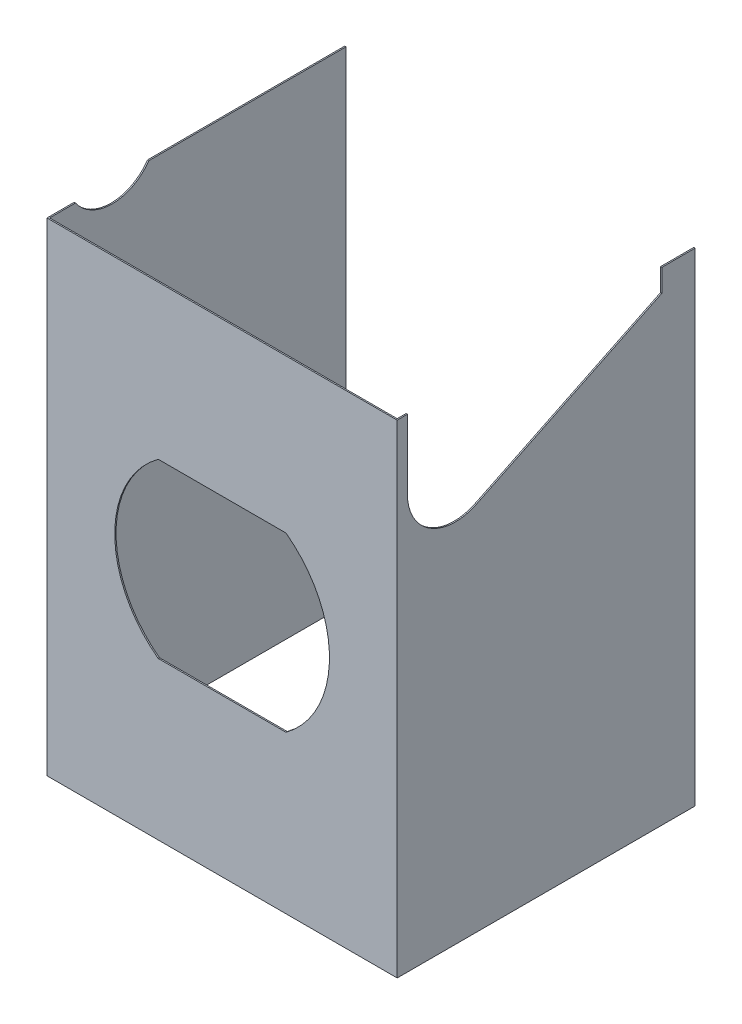
ISO-10303-21;
HEADER;
FILE_DESCRIPTION(('STEP AP214'),'2;1');
FILE_NAME('part.step','',(''),(''),'','','');
FILE_SCHEMA(('AUTOMOTIVE_DESIGN { 1 0 10303 214 1 1 1 1 }'));
ENDSEC;
DATA;
#1=APPLICATION_CONTEXT('core data for automotive mechanical design processes');
#2=APPLICATION_PROTOCOL_DEFINITION('international standard','automotive_design',2000,#1);
#3=PRODUCT_CONTEXT('',#1,'mechanical');
#4=PRODUCT('Part','Part','',(#3));
#5=PRODUCT_RELATED_PRODUCT_CATEGORY('part','',(#4));
#6=PRODUCT_DEFINITION_FORMATION('','',#4);
#7=PRODUCT_DEFINITION_CONTEXT('part definition',#1,'design');
#8=PRODUCT_DEFINITION('design','',#6,#7);
#9=PRODUCT_DEFINITION_SHAPE('','',#8);
#10=(LENGTH_UNIT() NAMED_UNIT(*) SI_UNIT(.MILLI.,.METRE.));
#11=(NAMED_UNIT(*) PLANE_ANGLE_UNIT() SI_UNIT($,.RADIAN.));
#12=(NAMED_UNIT(*) SI_UNIT($,.STERADIAN.) SOLID_ANGLE_UNIT());
#13=UNCERTAINTY_MEASURE_WITH_UNIT(LENGTH_MEASURE(1.E-05),#10,'distance_accuracy_value','');
#14=(GEOMETRIC_REPRESENTATION_CONTEXT(3) GLOBAL_UNCERTAINTY_ASSIGNED_CONTEXT((#13)) GLOBAL_UNIT_ASSIGNED_CONTEXT((#10,
#11,#12)) REPRESENTATION_CONTEXT('',''));
#15=CARTESIAN_POINT('',(0.,0.,0.));
#16=DIRECTION('',(0.,0.,1.));
#17=DIRECTION('',(1.,0.,0.));
#18=AXIS2_PLACEMENT_3D('',#15,#16,#17);
#19=CARTESIAN_POINT('',(0.,48.006,-0.254));
#20=DIRECTION('',(0.,-1.,0.));
#21=DIRECTION('',(0.,0.,-1.));
#22=AXIS2_PLACEMENT_3D('',#19,#20,#21);
#23=PLANE('',#22);
#24=DIRECTION('',(0.,0.,1.));
#25=VECTOR('',#24,1.);
#26=CARTESIAN_POINT('',(-34.544,48.006,0.));
#27=LINE('',#26,#25);
#28=CARTESIAN_POINT('',(-34.544,48.006,-5.4044054388967));
#29=VERTEX_POINT('',#28);
#30=CARTESIAN_POINT('',(-34.544,48.006,-0.254));
#31=VERTEX_POINT('',#30);
#32=EDGE_CURVE('E217',#29,#31,#27,.T.);
#33=ORIENTED_EDGE('',*,*,#32,.F.);
#34=DIRECTION('',(-1.,0.,0.));
#35=VECTOR('',#34,1.);
#36=CARTESIAN_POINT('',(-34.544,48.006,-5.4044054388967));
#37=LINE('',#36,#35);
#38=CARTESIAN_POINT('',(-34.798,48.006,-5.4044054388967));
#39=VERTEX_POINT('',#38);
#40=EDGE_CURVE('E72',#29,#39,#37,.T.);
#41=ORIENTED_EDGE('',*,*,#40,.T.);
#42=DIRECTION('',(0.,0.,1.));
#43=VECTOR('',#42,1.);
#44=CARTESIAN_POINT('',(-34.798,48.006,-0.254));
#45=LINE('',#44,#43);
#46=CARTESIAN_POINT('',(-34.798,48.006,0.));
#47=VERTEX_POINT('',#46);
#48=EDGE_CURVE('E371',#39,#47,#45,.T.);
#49=ORIENTED_EDGE('',*,*,#48,.T.);
#50=DIRECTION('',(1.,0.,0.));
#51=VECTOR('',#50,1.);
#52=CARTESIAN_POINT('',(0.,48.006,0.));
#53=LINE('',#52,#51);
#54=CARTESIAN_POINT('',(34.544,48.006,0.));
#55=VERTEX_POINT('',#54);
#56=EDGE_CURVE('E361',#47,#55,#53,.T.);
#57=ORIENTED_EDGE('',*,*,#56,.T.);
#58=DIRECTION('',(0.,0.,-1.));
#59=VECTOR('',#58,1.);
#60=CARTESIAN_POINT('',(34.544,48.006,-0.254));
#61=LINE('',#60,#59);
#62=CARTESIAN_POINT('',(34.544,48.006,-0.254));
#63=VERTEX_POINT('',#62);
#64=EDGE_CURVE('E312',#55,#63,#61,.T.);
#65=ORIENTED_EDGE('',*,*,#64,.T.);
#66=DIRECTION('',(1.,0.,0.));
#67=VECTOR('',#66,1.);
#68=CARTESIAN_POINT('',(0.,48.006,-0.254));
#69=LINE('',#68,#67);
#70=EDGE_CURVE('E339',#31,#63,#69,.T.);
#71=ORIENTED_EDGE('',*,*,#70,.F.);
#72=EDGE_LOOP('',(#33,#41,#49,#57,#65,#71));
#73=FACE_BOUND('',#72,.T.);
#74=ADVANCED_FACE('F56',(#73),#23,.F.);
#75=CARTESIAN_POINT('',(34.544,48.0095573922283,0.));
#76=DIRECTION('',(0.,1.,0.));
#77=DIRECTION('',(0.,0.,1.));
#78=AXIS2_PLACEMENT_3D('',#75,#76,#77);
#79=PLANE('',#78);
#80=DIRECTION('',(1.,0.,0.));
#81=VECTOR('',#80,1.);
#82=CARTESIAN_POINT('',(34.544,48.0095573922283,-2.03200000000001));
#83=LINE('',#82,#81);
#84=CARTESIAN_POINT('',(34.544,48.0095573922283,-2.03200000000001));
#85=VERTEX_POINT('',#84);
#86=CARTESIAN_POINT('',(34.798,48.0095573922283,-2.03200000000001));
#87=VERTEX_POINT('',#86);
#88=EDGE_CURVE('E271',#85,#87,#83,.T.);
#89=ORIENTED_EDGE('',*,*,#88,.F.);
#90=DIRECTION('',(0.,0.,1.));
#91=VECTOR('',#90,1.);
#92=CARTESIAN_POINT('',(34.544,48.0095573922283,0.));
#93=LINE('',#92,#91);
#94=CARTESIAN_POINT('',(34.544,48.0095573922283,0.));
#95=VERTEX_POINT('',#94);
#96=EDGE_CURVE('E295',#85,#95,#93,.T.);
#97=ORIENTED_EDGE('',*,*,#96,.T.);
#98=DIRECTION('',(1.,0.,0.));
#99=VECTOR('',#98,1.);
#100=CARTESIAN_POINT('',(34.544,48.0095573922283,0.));
#101=LINE('',#100,#99);
#102=CARTESIAN_POINT('',(34.798,48.0095573922283,0.));
#103=VERTEX_POINT('',#102);
#104=EDGE_CURVE('E308',#95,#103,#101,.T.);
#105=ORIENTED_EDGE('',*,*,#104,.T.);
#106=DIRECTION('',(0.,0.,1.));
#107=VECTOR('',#106,1.);
#108=CARTESIAN_POINT('',(34.798,48.0095573922283,0.));
#109=LINE('',#108,#107);
#110=EDGE_CURVE('E304',#87,#103,#109,.T.);
#111=ORIENTED_EDGE('',*,*,#110,.F.);
#112=EDGE_LOOP('',(#89,#97,#105,#111));
#113=FACE_BOUND('',#112,.T.);
#114=ADVANCED_FACE('F444',(#113),#79,.T.);
#115=CARTESIAN_POINT('',(0.,0.,0.));
#116=DIRECTION('',(0.,0.,1.));
#117=DIRECTION('',(1.,0.,0.));
#118=AXIS2_PLACEMENT_3D('',#115,#116,#117);
#119=PLANE('',#118);
#120=DIRECTION('',(1.,0.,0.));
#121=VECTOR('',#120,1.);
#122=CARTESIAN_POINT('',(0.,17.526,0.));
#123=LINE('',#122,#121);
#124=CARTESIAN_POINT('',(-12.6993649841242,17.526,0.));
#125=VERTEX_POINT('',#124);
#126=CARTESIAN_POINT('',(12.6993649841242,17.526,0.));
#127=VERTEX_POINT('',#126);
#128=EDGE_CURVE('E351',#125,#127,#123,.T.);
#129=ORIENTED_EDGE('',*,*,#128,.T.);
#130=CARTESIAN_POINT('',(0.,0.381000000000003,0.));
#131=DIRECTION('',(0.,0.,1.));
#132=DIRECTION('',(1.,0.,0.));
#133=AXIS2_PLACEMENT_3D('',#130,#131,#132);
#134=CIRCLE('',#133,21.336);
#135=CARTESIAN_POINT('',(12.6993649841242,-16.764,0.));
#136=VERTEX_POINT('',#135);
#137=EDGE_CURVE('E322',#136,#127,#134,.T.);
#138=ORIENTED_EDGE('',*,*,#137,.F.);
#139=DIRECTION('',(1.,0.,0.));
#140=VECTOR('',#139,1.);
#141=CARTESIAN_POINT('',(0.,-16.764,0.));
#142=LINE('',#141,#140);
#143=CARTESIAN_POINT('',(-12.6993649841242,-16.764,0.));
#144=VERTEX_POINT('',#143);
#145=EDGE_CURVE('E345',#144,#136,#142,.T.);
#146=ORIENTED_EDGE('',*,*,#145,.F.);
#147=CARTESIAN_POINT('',(0.,0.381000000000003,0.));
#148=DIRECTION('',(0.,0.,1.));
#149=DIRECTION('',(1.,0.,0.));
#150=AXIS2_PLACEMENT_3D('',#147,#148,#149);
#151=CIRCLE('',#150,21.336);
#152=EDGE_CURVE('E348',#125,#144,#151,.T.);
#153=ORIENTED_EDGE('',*,*,#152,.F.);
#154=EDGE_LOOP('',(#129,#138,#146,#153));
#155=FACE_BOUND('',#154,.T.);
#156=DIRECTION('',(0.,1.,0.));
#157=VECTOR('',#156,1.);
#158=CARTESIAN_POINT('',(34.798,0.,0.));
#159=LINE('',#158,#157);
#160=CARTESIAN_POINT('',(34.798,-48.006,0.));
#161=VERTEX_POINT('',#160);
#162=EDGE_CURVE('E358',#161,#103,#159,.T.);
#163=ORIENTED_EDGE('',*,*,#162,.T.);
#164=ORIENTED_EDGE('',*,*,#104,.F.);
#165=DIRECTION('',(0.,-1.,0.));
#166=VECTOR('',#165,1.);
#167=CARTESIAN_POINT('',(34.544,-48.006,0.));
#168=LINE('',#167,#166);
#169=EDGE_CURVE('E283',#95,#55,#168,.T.);
#170=ORIENTED_EDGE('',*,*,#169,.T.);
#171=ORIENTED_EDGE('',*,*,#56,.F.);
#172=DIRECTION('',(0.,1.,0.));
#173=VECTOR('',#172,1.);
#174=CARTESIAN_POINT('',(-34.798,0.,0.));
#175=LINE('',#174,#173);
#176=CARTESIAN_POINT('',(-34.798,-48.006,0.));
#177=VERTEX_POINT('',#176);
#178=EDGE_CURVE('E327',#177,#47,#175,.T.);
#179=ORIENTED_EDGE('',*,*,#178,.F.);
#180=DIRECTION('',(1.,0.,0.));
#181=VECTOR('',#180,1.);
#182=CARTESIAN_POINT('',(0.,-48.006,0.));
#183=LINE('',#182,#181);
#184=EDGE_CURVE('E355',#177,#161,#183,.T.);
#185=ORIENTED_EDGE('',*,*,#184,.T.);
#186=EDGE_LOOP('',(#163,#164,#170,#171,#179,#185));
#187=FACE_BOUND('',#186,.T.);
#188=ADVANCED_FACE('F406',(#155,#187),#119,.T.);
#189=CARTESIAN_POINT('',(0.,-48.006,-0.254));
#190=DIRECTION('',(0.,-1.,0.));
#191=DIRECTION('',(0.,0.,-1.));
#192=AXIS2_PLACEMENT_3D('',#189,#190,#191);
#193=PLANE('',#192);
#194=DIRECTION('',(0.,0.,1.));
#195=VECTOR('',#194,1.);
#196=CARTESIAN_POINT('',(34.798,-48.006,-0.254));
#197=LINE('',#196,#195);
#198=CARTESIAN_POINT('',(34.798,-48.006,-59.182));
#199=VERTEX_POINT('',#198);
#200=EDGE_CURVE('E372',#199,#161,#197,.T.);
#201=ORIENTED_EDGE('',*,*,#200,.T.);
#202=ORIENTED_EDGE('',*,*,#184,.F.);
#203=DIRECTION('',(0.,0.,1.));
#204=VECTOR('',#203,1.);
#205=CARTESIAN_POINT('',(-34.798,-48.006,-0.254));
#206=LINE('',#205,#204);
#207=CARTESIAN_POINT('',(-34.798,-48.006,-59.182));
#208=VERTEX_POINT('',#207);
#209=EDGE_CURVE('E366',#208,#177,#206,.T.);
#210=ORIENTED_EDGE('',*,*,#209,.F.);
#211=DIRECTION('',(-1.,0.,0.));
#212=VECTOR('',#211,1.);
#213=CARTESIAN_POINT('',(-34.544,-48.006,-59.182));
#214=LINE('',#213,#212);
#215=CARTESIAN_POINT('',(-34.544,-48.006,-59.182));
#216=VERTEX_POINT('',#215);
#217=EDGE_CURVE('E222',#216,#208,#214,.T.);
#218=ORIENTED_EDGE('',*,*,#217,.F.);
#219=DIRECTION('',(0.,0.,-1.));
#220=VECTOR('',#219,1.);
#221=CARTESIAN_POINT('',(-34.544,-48.006,0.));
#222=LINE('',#221,#220);
#223=CARTESIAN_POINT('',(-34.544,-48.006,-0.254));
#224=VERTEX_POINT('',#223);
#225=EDGE_CURVE('E230',#224,#216,#222,.T.);
#226=ORIENTED_EDGE('',*,*,#225,.F.);
#227=DIRECTION('',(1.,0.,0.));
#228=VECTOR('',#227,1.);
#229=CARTESIAN_POINT('',(0.,-48.006,-0.254));
#230=LINE('',#229,#228);
#231=CARTESIAN_POINT('',(34.544,-48.006,-0.254));
#232=VERTEX_POINT('',#231);
#233=EDGE_CURVE('E79',#224,#232,#230,.T.);
#234=ORIENTED_EDGE('',*,*,#233,.T.);
#235=DIRECTION('',(0.,0.,-1.));
#236=VECTOR('',#235,1.);
#237=CARTESIAN_POINT('',(34.544,-48.006,0.));
#238=LINE('',#237,#236);
#239=CARTESIAN_POINT('',(34.544,-48.006,-59.182));
#240=VERTEX_POINT('',#239);
#241=EDGE_CURVE('E287',#232,#240,#238,.T.);
#242=ORIENTED_EDGE('',*,*,#241,.T.);
#243=DIRECTION('',(1.,0.,0.));
#244=VECTOR('',#243,1.);
#245=CARTESIAN_POINT('',(34.544,-48.006,-59.182));
#246=LINE('',#245,#244);
#247=EDGE_CURVE('E300',#240,#199,#246,.T.);
#248=ORIENTED_EDGE('',*,*,#247,.T.);
#249=EDGE_LOOP('',(#201,#202,#210,#218,#226,#234,#242,#248));
#250=FACE_BOUND('',#249,.T.);
#251=ADVANCED_FACE('F452',(#250),#193,.T.);
#252=CARTESIAN_POINT('',(-34.798,0.,-0.254));
#253=DIRECTION('',(1.,0.,0.));
#254=DIRECTION('',(0.,0.,-1.));
#255=AXIS2_PLACEMENT_3D('',#252,#253,#254);
#256=PLANE('',#255);
#257=ORIENTED_EDGE('',*,*,#178,.T.);
#258=ORIENTED_EDGE('',*,*,#48,.F.);
#259=CARTESIAN_POINT('',(-34.798,53.086,-12.7));
#260=DIRECTION('',(-1.,0.,0.));
#261=DIRECTION('',(0.,0.,1.));
#262=AXIS2_PLACEMENT_3D('',#259,#260,#261);
#263=CIRCLE('',#262,8.89);
#264=CARTESIAN_POINT('',(-34.798,48.006,-19.9955945611033));
#265=VERTEX_POINT('',#264);
#266=EDGE_CURVE('E200',#265,#39,#263,.T.);
#267=ORIENTED_EDGE('',*,*,#266,.F.);
#268=CARTESIAN_POINT('',(-34.798,48.006,-59.182));
#269=VERTEX_POINT('',#268);
#270=EDGE_CURVE('E208',#269,#265,#45,.T.);
#271=ORIENTED_EDGE('',*,*,#270,.F.);
#272=DIRECTION('',(0.,1.,0.));
#273=VECTOR('',#272,1.);
#274=CARTESIAN_POINT('',(-34.798,48.006,-59.182));
#275=LINE('',#274,#273);
#276=EDGE_CURVE('E227',#208,#269,#275,.T.);
#277=ORIENTED_EDGE('',*,*,#276,.F.);
#278=ORIENTED_EDGE('',*,*,#209,.T.);
#279=EDGE_LOOP('',(#257,#258,#267,#271,#277,#278));
#280=FACE_BOUND('',#279,.T.);
#281=ADVANCED_FACE('F534',(#280),#256,.F.);
#282=ORIENTED_EDGE('',*,*,#270,.T.);
#283=DIRECTION('',(-1.,0.,0.));
#284=VECTOR('',#283,1.);
#285=CARTESIAN_POINT('',(-34.544,48.006,-19.9955945611033));
#286=LINE('',#285,#284);
#287=CARTESIAN_POINT('',(-34.544,48.006,-19.9955945611033));
#288=VERTEX_POINT('',#287);
#289=EDGE_CURVE('E194',#265,#288,#286,.F.);
#290=ORIENTED_EDGE('',*,*,#289,.T.);
#291=CARTESIAN_POINT('',(-34.544,48.006,-59.182));
#292=VERTEX_POINT('',#291);
#293=EDGE_CURVE('E207',#292,#288,#27,.T.);
#294=ORIENTED_EDGE('',*,*,#293,.F.);
#295=DIRECTION('',(-1.,0.,0.));
#296=VECTOR('',#295,1.);
#297=CARTESIAN_POINT('',(-34.544,48.006,-59.182));
#298=LINE('',#297,#296);
#299=EDGE_CURVE('E216',#292,#269,#298,.T.);
#300=ORIENTED_EDGE('',*,*,#299,.T.);
#301=EDGE_LOOP('',(#282,#290,#294,#300));
#302=FACE_BOUND('',#301,.T.);
#303=ADVANCED_FACE('F205',(#302),#23,.F.);
#304=CARTESIAN_POINT('',(0.,0.381000000000003,-0.254));
#305=DIRECTION('',(0.,0.,1.));
#306=DIRECTION('',(1.,0.,0.));
#307=AXIS2_PLACEMENT_3D('',#304,#305,#306);
#308=CYLINDRICAL_SURFACE('',#307,21.336);
#309=ORIENTED_EDGE('',*,*,#137,.T.);
#310=DIRECTION('',(0.,0.,1.));
#311=VECTOR('',#310,1.);
#312=CARTESIAN_POINT('',(12.6993649841242,17.526,-0.254));
#313=LINE('',#312,#311);
#314=CARTESIAN_POINT('',(12.6993649841242,17.526,-0.254));
#315=VERTEX_POINT('',#314);
#316=EDGE_CURVE('E376',#315,#127,#313,.T.);
#317=ORIENTED_EDGE('',*,*,#316,.F.);
#318=CARTESIAN_POINT('',(0.,0.381000000000003,-0.254));
#319=DIRECTION('',(0.,0.,1.));
#320=DIRECTION('',(1.,0.,0.));
#321=AXIS2_PLACEMENT_3D('',#318,#319,#320);
#322=CIRCLE('',#321,21.336);
#323=CARTESIAN_POINT('',(12.6993649841242,-16.764,-0.254));
#324=VERTEX_POINT('',#323);
#325=EDGE_CURVE('E323',#324,#315,#322,.T.);
#326=ORIENTED_EDGE('',*,*,#325,.F.);
#327=DIRECTION('',(0.,0.,1.));
#328=VECTOR('',#327,1.);
#329=CARTESIAN_POINT('',(12.6993649841242,-16.764,-0.254));
#330=LINE('',#329,#328);
#331=EDGE_CURVE('E342',#324,#136,#330,.T.);
#332=ORIENTED_EDGE('',*,*,#331,.T.);
#333=EDGE_LOOP('',(#309,#317,#326,#332));
#334=FACE_BOUND('',#333,.T.);
#335=ADVANCED_FACE('F58',(#334),#308,.F.);
#336=CARTESIAN_POINT('',(0.,17.526,-0.254));
#337=DIRECTION('',(0.,-1.,0.));
#338=DIRECTION('',(1.,0.,0.));
#339=AXIS2_PLACEMENT_3D('',#336,#337,#338);
#340=PLANE('',#339);
#341=ORIENTED_EDGE('',*,*,#128,.F.);
#342=DIRECTION('',(0.,0.,1.));
#343=VECTOR('',#342,1.);
#344=CARTESIAN_POINT('',(-12.6993649841242,17.526,-0.254));
#345=LINE('',#344,#343);
#346=CARTESIAN_POINT('',(-12.6993649841242,17.526,-0.254));
#347=VERTEX_POINT('',#346);
#348=EDGE_CURVE('E380',#347,#125,#345,.T.);
#349=ORIENTED_EDGE('',*,*,#348,.F.);
#350=DIRECTION('',(1.,0.,0.));
#351=VECTOR('',#350,1.);
#352=CARTESIAN_POINT('',(0.,17.526,-0.254));
#353=LINE('',#352,#351);
#354=EDGE_CURVE('E333',#347,#315,#353,.T.);
#355=ORIENTED_EDGE('',*,*,#354,.T.);
#356=ORIENTED_EDGE('',*,*,#316,.T.);
#357=EDGE_LOOP('',(#341,#349,#355,#356));
#358=FACE_BOUND('',#357,.T.);
#359=ADVANCED_FACE('F636',(#358),#340,.T.);
#360=CARTESIAN_POINT('',(0.,0.381000000000003,-0.254));
#361=DIRECTION('',(0.,0.,1.));
#362=DIRECTION('',(1.,0.,0.));
#363=AXIS2_PLACEMENT_3D('',#360,#361,#362);
#364=CYLINDRICAL_SURFACE('',#363,21.336);
#365=ORIENTED_EDGE('',*,*,#152,.T.);
#366=DIRECTION('',(0.,0.,1.));
#367=VECTOR('',#366,1.);
#368=CARTESIAN_POINT('',(-12.6993649841242,-16.764,-0.254));
#369=LINE('',#368,#367);
#370=CARTESIAN_POINT('',(-12.6993649841242,-16.764,-0.254));
#371=VERTEX_POINT('',#370);
#372=EDGE_CURVE('E383',#371,#144,#369,.T.);
#373=ORIENTED_EDGE('',*,*,#372,.F.);
#374=CARTESIAN_POINT('',(0.,0.381000000000003,-0.254));
#375=DIRECTION('',(0.,0.,1.));
#376=DIRECTION('',(1.,0.,0.));
#377=AXIS2_PLACEMENT_3D('',#374,#375,#376);
#378=CIRCLE('',#377,21.336);
#379=EDGE_CURVE('E330',#347,#371,#378,.T.);
#380=ORIENTED_EDGE('',*,*,#379,.F.);
#381=ORIENTED_EDGE('',*,*,#348,.T.);
#382=EDGE_LOOP('',(#365,#373,#380,#381));
#383=FACE_BOUND('',#382,.T.);
#384=ADVANCED_FACE('F627',(#383),#364,.F.);
#385=CARTESIAN_POINT('',(0.,-16.764,-0.254));
#386=DIRECTION('',(0.,-1.,0.));
#387=DIRECTION('',(0.,0.,-1.));
#388=AXIS2_PLACEMENT_3D('',#385,#386,#387);
#389=PLANE('',#388);
#390=ORIENTED_EDGE('',*,*,#145,.T.);
#391=ORIENTED_EDGE('',*,*,#331,.F.);
#392=DIRECTION('',(1.,0.,0.));
#393=VECTOR('',#392,1.);
#394=CARTESIAN_POINT('',(0.,-16.764,-0.254));
#395=LINE('',#394,#393);
#396=EDGE_CURVE('E326',#371,#324,#395,.T.);
#397=ORIENTED_EDGE('',*,*,#396,.F.);
#398=ORIENTED_EDGE('',*,*,#372,.T.);
#399=EDGE_LOOP('',(#390,#391,#397,#398));
#400=FACE_BOUND('',#399,.T.);
#401=ADVANCED_FACE('F618',(#400),#389,.F.);
#402=CARTESIAN_POINT('',(34.798,0.,-0.254));
#403=DIRECTION('',(1.,0.,0.));
#404=DIRECTION('',(0.,0.,-1.));
#405=AXIS2_PLACEMENT_3D('',#402,#403,#404);
#406=PLANE('',#405);
#407=ORIENTED_EDGE('',*,*,#110,.T.);
#408=ORIENTED_EDGE('',*,*,#162,.F.);
#409=ORIENTED_EDGE('',*,*,#200,.F.);
#410=DIRECTION('',(0.,1.,0.));
#411=VECTOR('',#410,1.);
#412=CARTESIAN_POINT('',(34.798,-48.006,-59.182));
#413=LINE('',#412,#411);
#414=CARTESIAN_POINT('',(34.798,48.0095573922283,-59.182));
#415=VERTEX_POINT('',#414);
#416=EDGE_CURVE('E270',#199,#415,#413,.T.);
#417=ORIENTED_EDGE('',*,*,#416,.T.);
#418=CARTESIAN_POINT('',(34.798,48.0095573922283,-52.578));
#419=VERTEX_POINT('',#418);
#420=EDGE_CURVE('E288',#415,#419,#109,.T.);
#421=ORIENTED_EDGE('',*,*,#420,.T.);
#422=DIRECTION('',(0.,1.,0.));
#423=VECTOR('',#422,1.);
#424=CARTESIAN_POINT('',(34.798,48.0095573922283,-52.578));
#425=LINE('',#424,#423);
#426=CARTESIAN_POINT('',(34.798,43.5363621467436,-52.578));
#427=VERTEX_POINT('',#426);
#428=EDGE_CURVE('E261',#427,#419,#425,.T.);
#429=ORIENTED_EDGE('',*,*,#428,.F.);
#430=DIRECTION('',(0.,0.436412035614758,-0.899746928402972));
#431=VECTOR('',#430,1.);
#432=CARTESIAN_POINT('',(34.798,25.6558122914542,-15.7138246392306));
#433=LINE('',#432,#431);
#434=CARTESIAN_POINT('',(34.798,25.6558122914542,-15.7138246392306));
#435=VERTEX_POINT('',#434);
#436=EDGE_CURVE('E257',#435,#427,#433,.T.);
#437=ORIENTED_EDGE('',*,*,#436,.F.);
#438=CARTESIAN_POINT('',(34.798,34.2259017844925,-11.557));
#439=DIRECTION('',(1.,0.,0.));
#440=DIRECTION('',(0.,0.,-1.));
#441=AXIS2_PLACEMENT_3D('',#438,#439,#440);
#442=CIRCLE('',#441,9.525);
#443=CARTESIAN_POINT('',(34.798,34.2259017844925,-2.032));
#444=VERTEX_POINT('',#443);
#445=EDGE_CURVE('E235',#444,#435,#442,.T.);
#446=ORIENTED_EDGE('',*,*,#445,.F.);
#447=DIRECTION('',(0.,-1.,0.));
#448=VECTOR('',#447,1.);
#449=CARTESIAN_POINT('',(34.798,34.2259017844925,-2.032));
#450=LINE('',#449,#448);
#451=EDGE_CURVE('E241',#87,#444,#450,.T.);
#452=ORIENTED_EDGE('',*,*,#451,.F.);
#453=EDGE_LOOP('',(#407,#408,#409,#417,#421,#429,#437,#446,#452));
#454=FACE_BOUND('',#453,.T.);
#455=ADVANCED_FACE('F442',(#454),#406,.T.);
#456=CARTESIAN_POINT('',(0.,0.,-0.254));
#457=DIRECTION('',(0.,0.,1.));
#458=DIRECTION('',(1.,0.,0.));
#459=AXIS2_PLACEMENT_3D('',#456,#457,#458);
#460=PLANE('',#459);
#461=ORIENTED_EDGE('',*,*,#325,.T.);
#462=ORIENTED_EDGE('',*,*,#354,.F.);
#463=ORIENTED_EDGE('',*,*,#379,.T.);
#464=ORIENTED_EDGE('',*,*,#396,.T.);
#465=EDGE_LOOP('',(#461,#462,#463,#464));
#466=FACE_BOUND('',#465,.T.);
#467=ORIENTED_EDGE('',*,*,#233,.F.);
#468=DIRECTION('',(0.,1.,0.));
#469=VECTOR('',#468,1.);
#470=CARTESIAN_POINT('',(-34.544,0.,-0.254));
#471=LINE('',#470,#469);
#472=EDGE_CURVE('E13',#224,#31,#471,.T.);
#473=ORIENTED_EDGE('',*,*,#472,.T.);
#474=ORIENTED_EDGE('',*,*,#70,.T.);
#475=DIRECTION('',(0.,-1.,0.));
#476=VECTOR('',#475,1.);
#477=CARTESIAN_POINT('',(34.544,0.,-0.254));
#478=LINE('',#477,#476);
#479=EDGE_CURVE('E65',#63,#232,#478,.T.);
#480=ORIENTED_EDGE('',*,*,#479,.T.);
#481=EDGE_LOOP('',(#467,#473,#474,#480));
#482=FACE_BOUND('',#481,.T.);
#483=ADVANCED_FACE('F392',(#466,#482),#460,.F.);
#484=CARTESIAN_POINT('',(34.544,0.,0.));
#485=DIRECTION('',(-1.,0.,0.));
#486=DIRECTION('',(0.,0.,1.));
#487=AXIS2_PLACEMENT_3D('',#484,#485,#486);
#488=PLANE('',#487);
#489=DIRECTION('',(0.,-1.,0.));
#490=VECTOR('',#489,1.);
#491=CARTESIAN_POINT('',(34.544,34.2259017844925,-2.032));
#492=LINE('',#491,#490);
#493=CARTESIAN_POINT('',(34.544,34.2259017844925,-2.032));
#494=VERTEX_POINT('',#493);
#495=EDGE_CURVE('E249',#85,#494,#492,.T.);
#496=ORIENTED_EDGE('',*,*,#495,.T.);
#497=CARTESIAN_POINT('',(34.544,34.2259017844925,-11.557));
#498=DIRECTION('',(1.,0.,0.));
#499=DIRECTION('',(0.,0.,-1.));
#500=AXIS2_PLACEMENT_3D('',#497,#498,#499);
#501=CIRCLE('',#500,9.525);
#502=CARTESIAN_POINT('',(34.544,25.6558122914542,-15.7138246392306));
#503=VERTEX_POINT('',#502);
#504=EDGE_CURVE('E236',#494,#503,#501,.T.);
#505=ORIENTED_EDGE('',*,*,#504,.T.);
#506=DIRECTION('',(0.,0.436412035614758,-0.899746928402972));
#507=VECTOR('',#506,1.);
#508=CARTESIAN_POINT('',(34.544,25.6558122914542,-15.7138246392306));
#509=LINE('',#508,#507);
#510=CARTESIAN_POINT('',(34.544,43.5363621467436,-52.578));
#511=VERTEX_POINT('',#510);
#512=EDGE_CURVE('E240',#503,#511,#509,.T.);
#513=ORIENTED_EDGE('',*,*,#512,.T.);
#514=DIRECTION('',(0.,1.,0.));
#515=VECTOR('',#514,1.);
#516=CARTESIAN_POINT('',(34.544,48.0095573922283,-52.578));
#517=LINE('',#516,#515);
#518=CARTESIAN_POINT('',(34.544,48.0095573922283,-52.578));
#519=VERTEX_POINT('',#518);
#520=EDGE_CURVE('E245',#511,#519,#517,.T.);
#521=ORIENTED_EDGE('',*,*,#520,.T.);
#522=CARTESIAN_POINT('',(34.544,48.0095573922283,-59.182));
#523=VERTEX_POINT('',#522);
#524=EDGE_CURVE('E296',#523,#519,#93,.T.);
#525=ORIENTED_EDGE('',*,*,#524,.F.);
#526=DIRECTION('',(0.,1.,0.));
#527=VECTOR('',#526,1.);
#528=CARTESIAN_POINT('',(34.544,-48.006,-59.182));
#529=LINE('',#528,#527);
#530=EDGE_CURVE('E291',#240,#523,#529,.T.);
#531=ORIENTED_EDGE('',*,*,#530,.F.);
#532=ORIENTED_EDGE('',*,*,#241,.F.);
#533=ORIENTED_EDGE('',*,*,#479,.F.);
#534=ORIENTED_EDGE('',*,*,#64,.F.);
#535=ORIENTED_EDGE('',*,*,#169,.F.);
#536=ORIENTED_EDGE('',*,*,#96,.F.);
#537=EDGE_LOOP('',(#496,#505,#513,#521,#525,#531,#532,#533,#534,#535,#536));
#538=FACE_BOUND('',#537,.T.);
#539=ADVANCED_FACE('F397',(#538),#488,.T.);
#540=DIRECTION('',(1.,0.,0.));
#541=VECTOR('',#540,1.);
#542=CARTESIAN_POINT('',(34.544,48.0095573922283,-52.578));
#543=LINE('',#542,#541);
#544=EDGE_CURVE('E274',#519,#419,#543,.T.);
#545=ORIENTED_EDGE('',*,*,#544,.T.);
#546=ORIENTED_EDGE('',*,*,#420,.F.);
#547=DIRECTION('',(1.,0.,0.));
#548=VECTOR('',#547,1.);
#549=CARTESIAN_POINT('',(34.544,48.0095573922283,-59.182));
#550=LINE('',#549,#548);
#551=EDGE_CURVE('E313',#523,#415,#550,.T.);
#552=ORIENTED_EDGE('',*,*,#551,.F.);
#553=ORIENTED_EDGE('',*,*,#524,.T.);
#554=EDGE_LOOP('',(#545,#546,#552,#553));
#555=FACE_BOUND('',#554,.T.);
#556=ADVANCED_FACE('F447',(#555),#79,.T.);
#557=CARTESIAN_POINT('',(34.544,-48.006,-59.182));
#558=DIRECTION('',(0.,0.,-1.));
#559=DIRECTION('',(-1.,0.,0.));
#560=AXIS2_PLACEMENT_3D('',#557,#558,#559);
#561=PLANE('',#560);
#562=ORIENTED_EDGE('',*,*,#416,.F.);
#563=ORIENTED_EDGE('',*,*,#247,.F.);
#564=ORIENTED_EDGE('',*,*,#530,.T.);
#565=ORIENTED_EDGE('',*,*,#551,.T.);
#566=EDGE_LOOP('',(#562,#563,#564,#565));
#567=FACE_BOUND('',#566,.T.);
#568=ADVANCED_FACE('F459',(#567),#561,.T.);
#569=CARTESIAN_POINT('',(34.544,34.2259017844925,-11.557));
#570=DIRECTION('',(1.,0.,0.));
#571=DIRECTION('',(0.,0.,-1.));
#572=AXIS2_PLACEMENT_3D('',#569,#570,#571);
#573=CYLINDRICAL_SURFACE('',#572,9.525);
#574=ORIENTED_EDGE('',*,*,#445,.T.);
#575=DIRECTION('',(1.,0.,0.));
#576=VECTOR('',#575,1.);
#577=CARTESIAN_POINT('',(34.544,25.6558122914542,-15.7138246392306));
#578=LINE('',#577,#576);
#579=EDGE_CURVE('E253',#503,#435,#578,.T.);
#580=ORIENTED_EDGE('',*,*,#579,.F.);
#581=ORIENTED_EDGE('',*,*,#504,.F.);
#582=DIRECTION('',(1.,0.,0.));
#583=VECTOR('',#582,1.);
#584=CARTESIAN_POINT('',(34.544,34.2259017844925,-2.032));
#585=LINE('',#584,#583);
#586=EDGE_CURVE('E267',#494,#444,#585,.T.);
#587=ORIENTED_EDGE('',*,*,#586,.T.);
#588=EDGE_LOOP('',(#574,#580,#581,#587));
#589=FACE_BOUND('',#588,.T.);
#590=ADVANCED_FACE('F465',(#589),#573,.F.);
#591=CARTESIAN_POINT('',(34.544,34.2259017844925,-2.032));
#592=DIRECTION('',(0.,0.,1.));
#593=DIRECTION('',(0.,-1.,0.));
#594=AXIS2_PLACEMENT_3D('',#591,#592,#593);
#595=PLANE('',#594);
#596=ORIENTED_EDGE('',*,*,#451,.T.);
#597=ORIENTED_EDGE('',*,*,#586,.F.);
#598=ORIENTED_EDGE('',*,*,#495,.F.);
#599=ORIENTED_EDGE('',*,*,#88,.T.);
#600=EDGE_LOOP('',(#596,#597,#598,#599));
#601=FACE_BOUND('',#600,.T.);
#602=ADVANCED_FACE('F482',(#601),#595,.F.);
#603=CARTESIAN_POINT('',(34.544,48.0095573922283,-52.578));
#604=DIRECTION('',(0.,0.,-1.));
#605=DIRECTION('',(0.,1.,0.));
#606=AXIS2_PLACEMENT_3D('',#603,#604,#605);
#607=PLANE('',#606);
#608=ORIENTED_EDGE('',*,*,#428,.T.);
#609=ORIENTED_EDGE('',*,*,#544,.F.);
#610=ORIENTED_EDGE('',*,*,#520,.F.);
#611=DIRECTION('',(1.,0.,0.));
#612=VECTOR('',#611,1.);
#613=CARTESIAN_POINT('',(34.544,43.5363621467436,-52.578));
#614=LINE('',#613,#612);
#615=EDGE_CURVE('E278',#511,#427,#614,.T.);
#616=ORIENTED_EDGE('',*,*,#615,.T.);
#617=EDGE_LOOP('',(#608,#609,#610,#616));
#618=FACE_BOUND('',#617,.T.);
#619=ADVANCED_FACE('F476',(#618),#607,.F.);
#620=CARTESIAN_POINT('',(34.544,25.6558122914542,-15.7138246392306));
#621=DIRECTION('',(0.,-0.899746928402972,-0.436412035614758));
#622=DIRECTION('',(0.,0.436412035614758,-0.899746928402972));
#623=AXIS2_PLACEMENT_3D('',#620,#621,#622);
#624=PLANE('',#623);
#625=ORIENTED_EDGE('',*,*,#436,.T.);
#626=ORIENTED_EDGE('',*,*,#615,.F.);
#627=ORIENTED_EDGE('',*,*,#512,.F.);
#628=ORIENTED_EDGE('',*,*,#579,.T.);
#629=EDGE_LOOP('',(#625,#626,#627,#628));
#630=FACE_BOUND('',#629,.T.);
#631=ADVANCED_FACE('F478',(#630),#624,.F.);
#632=CARTESIAN_POINT('',(-34.544,0.,0.));
#633=DIRECTION('',(1.,0.,0.));
#634=DIRECTION('',(0.,0.,-1.));
#635=AXIS2_PLACEMENT_3D('',#632,#633,#634);
#636=PLANE('',#635);
#637=CARTESIAN_POINT('',(-34.544,53.086,-12.7));
#638=DIRECTION('',(-1.,0.,0.));
#639=DIRECTION('',(0.,0.,1.));
#640=AXIS2_PLACEMENT_3D('',#637,#638,#639);
#641=CIRCLE('',#640,8.89);
#642=EDGE_CURVE('E191',#288,#29,#641,.T.);
#643=ORIENTED_EDGE('',*,*,#642,.T.);
#644=ORIENTED_EDGE('',*,*,#32,.T.);
#645=ORIENTED_EDGE('',*,*,#472,.F.);
#646=ORIENTED_EDGE('',*,*,#225,.T.);
#647=DIRECTION('',(0.,1.,0.));
#648=VECTOR('',#647,1.);
#649=CARTESIAN_POINT('',(-34.544,48.006,-59.182));
#650=LINE('',#649,#648);
#651=EDGE_CURVE('E213',#216,#292,#650,.T.);
#652=ORIENTED_EDGE('',*,*,#651,.T.);
#653=ORIENTED_EDGE('',*,*,#293,.T.);
#654=EDGE_LOOP('',(#643,#644,#645,#646,#652,#653));
#655=FACE_BOUND('',#654,.T.);
#656=ADVANCED_FACE('F211',(#655),#636,.T.);
#657=CARTESIAN_POINT('',(-34.544,48.006,-59.182));
#658=DIRECTION('',(0.,0.,1.));
#659=DIRECTION('',(1.,0.,0.));
#660=AXIS2_PLACEMENT_3D('',#657,#658,#659);
#661=PLANE('',#660);
#662=ORIENTED_EDGE('',*,*,#276,.T.);
#663=ORIENTED_EDGE('',*,*,#299,.F.);
#664=ORIENTED_EDGE('',*,*,#651,.F.);
#665=ORIENTED_EDGE('',*,*,#217,.T.);
#666=EDGE_LOOP('',(#662,#663,#664,#665));
#667=FACE_BOUND('',#666,.T.);
#668=ADVANCED_FACE('F492',(#667),#661,.F.);
#669=CARTESIAN_POINT('',(-34.544,53.086,-12.7));
#670=DIRECTION('',(-1.,0.,0.));
#671=DIRECTION('',(0.,0.,1.));
#672=AXIS2_PLACEMENT_3D('',#669,#670,#671);
#673=CYLINDRICAL_SURFACE('',#672,8.89);
#674=ORIENTED_EDGE('',*,*,#642,.F.);
#675=ORIENTED_EDGE('',*,*,#289,.F.);
#676=ORIENTED_EDGE('',*,*,#266,.T.);
#677=ORIENTED_EDGE('',*,*,#40,.F.);
#678=EDGE_LOOP('',(#674,#675,#676,#677));
#679=FACE_BOUND('',#678,.T.);
#680=ADVANCED_FACE('F193',(#679),#673,.F.);
#681=CLOSED_SHELL('',(#74,#114,#188,#251,#281,#303,#335,#359,#384,#401,#455,#483,#539,#556,#568,
#590,#602,#619,#631,#656,#668,#680));
#682=MANIFOLD_SOLID_BREP('B2',#681);
#683=ADVANCED_BREP_SHAPE_REPRESENTATION('',(#18,#682),#14);
#684=SHAPE_DEFINITION_REPRESENTATION(#9,#683);
ENDSEC;
END-ISO-10303-21;
